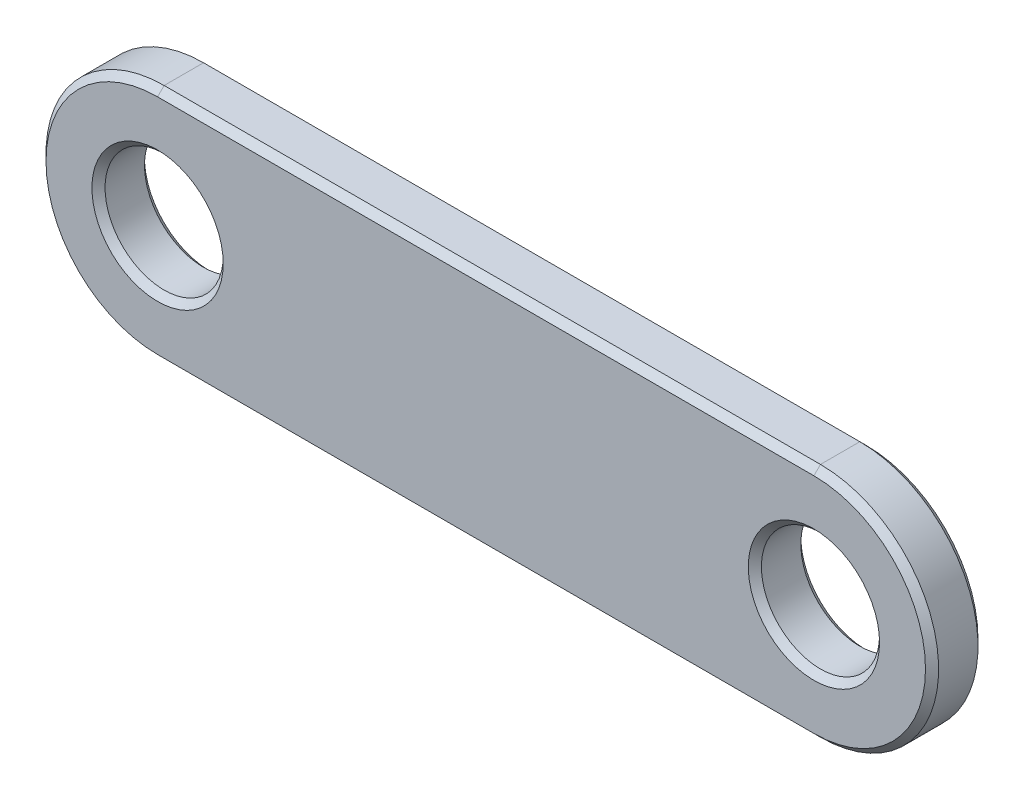
ISO-10303-21;
HEADER;
FILE_DESCRIPTION(('STEP AP214'),'2;1');
FILE_NAME('part.step','',(''),(''),'','','');
FILE_SCHEMA(('AUTOMOTIVE_DESIGN { 1 0 10303 214 1 1 1 1 }'));
ENDSEC;
DATA;
#1=APPLICATION_CONTEXT('core data for automotive mechanical design processes');
#2=APPLICATION_PROTOCOL_DEFINITION('international standard','automotive_design',2000,#1);
#3=PRODUCT_CONTEXT('',#1,'mechanical');
#4=PRODUCT('Part','Part','',(#3));
#5=PRODUCT_RELATED_PRODUCT_CATEGORY('part','',(#4));
#6=PRODUCT_DEFINITION_FORMATION('','',#4);
#7=PRODUCT_DEFINITION_CONTEXT('part definition',#1,'design');
#8=PRODUCT_DEFINITION('design','',#6,#7);
#9=PRODUCT_DEFINITION_SHAPE('','',#8);
#10=(LENGTH_UNIT() NAMED_UNIT(*) SI_UNIT(.MILLI.,.METRE.));
#11=(NAMED_UNIT(*) PLANE_ANGLE_UNIT() SI_UNIT($,.RADIAN.));
#12=(NAMED_UNIT(*) SI_UNIT($,.STERADIAN.) SOLID_ANGLE_UNIT());
#13=UNCERTAINTY_MEASURE_WITH_UNIT(LENGTH_MEASURE(1.E-05),#10,'distance_accuracy_value','');
#14=(GEOMETRIC_REPRESENTATION_CONTEXT(3) GLOBAL_UNCERTAINTY_ASSIGNED_CONTEXT((#13)) GLOBAL_UNIT_ASSIGNED_CONTEXT((#10,
#11,#12)) REPRESENTATION_CONTEXT('',''));
#15=CARTESIAN_POINT('',(0.,0.,0.));
#16=DIRECTION('',(0.,0.,1.));
#17=DIRECTION('',(1.,0.,0.));
#18=AXIS2_PLACEMENT_3D('',#15,#16,#17);
#19=CARTESIAN_POINT('',(-63.5,0.,5.08));
#20=DIRECTION('',(0.,0.,1.));
#21=DIRECTION('',(1.,0.,0.));
#22=AXIS2_PLACEMENT_3D('',#19,#20,#21);
#23=PLANE('',#22);
#24=CARTESIAN_POINT('',(-63.5,0.,5.08));
#25=DIRECTION('',(0.,0.,1.));
#26=DIRECTION('',(1.,0.,0.));
#27=AXIS2_PLACEMENT_3D('',#24,#25,#26);
#28=CIRCLE('',#27,6.35);
#29=CARTESIAN_POINT('',(-57.15,0.,5.08));
#30=VERTEX_POINT('',#29);
#31=EDGE_CURVE('E9',#30,#30,#28,.F.);
#32=ORIENTED_EDGE('',*,*,#31,.T.);
#33=EDGE_LOOP('',(#32));
#34=FACE_BOUND('',#33,.T.);
#35=CARTESIAN_POINT('',(0.,0.,5.08));
#36=DIRECTION('',(0.,0.,1.));
#37=DIRECTION('',(1.,0.,0.));
#38=AXIS2_PLACEMENT_3D('',#35,#36,#37);
#39=CIRCLE('',#38,10.795);
#40=CARTESIAN_POINT('',(0.,-10.795,5.08));
#41=VERTEX_POINT('',#40);
#42=CARTESIAN_POINT('',(0.,10.795,5.08));
#43=VERTEX_POINT('',#42);
#44=EDGE_CURVE('E31',#41,#43,#39,.T.);
#45=ORIENTED_EDGE('',*,*,#44,.T.);
#46=DIRECTION('',(-1.,0.,0.));
#47=VECTOR('',#46,1.);
#48=CARTESIAN_POINT('',(-63.5,10.795,5.08));
#49=LINE('',#48,#47);
#50=CARTESIAN_POINT('',(-63.5,10.795,5.08));
#51=VERTEX_POINT('',#50);
#52=EDGE_CURVE('E23',#43,#51,#49,.T.);
#53=ORIENTED_EDGE('',*,*,#52,.T.);
#54=CARTESIAN_POINT('',(-63.5,0.,5.08));
#55=DIRECTION('',(0.,0.,1.));
#56=DIRECTION('',(1.,0.,0.));
#57=AXIS2_PLACEMENT_3D('',#54,#55,#56);
#58=CIRCLE('',#57,10.795);
#59=CARTESIAN_POINT('',(-63.5,-10.795,5.08));
#60=VERTEX_POINT('',#59);
#61=EDGE_CURVE('E149',#51,#60,#58,.T.);
#62=ORIENTED_EDGE('',*,*,#61,.T.);
#63=DIRECTION('',(1.,0.,0.));
#64=VECTOR('',#63,1.);
#65=CARTESIAN_POINT('',(0.,-10.795,5.08));
#66=LINE('',#65,#64);
#67=EDGE_CURVE('E36',#60,#41,#66,.T.);
#68=ORIENTED_EDGE('',*,*,#67,.T.);
#69=EDGE_LOOP('',(#45,#53,#62,#68));
#70=FACE_BOUND('',#69,.T.);
#71=CARTESIAN_POINT('',(0.,0.,5.08));
#72=DIRECTION('',(0.,0.,1.));
#73=DIRECTION('',(1.,0.,0.));
#74=AXIS2_PLACEMENT_3D('',#71,#72,#73);
#75=CIRCLE('',#74,6.35);
#76=CARTESIAN_POINT('',(6.35,0.,5.08));
#77=VERTEX_POINT('',#76);
#78=EDGE_CURVE('E146',#77,#77,#75,.F.);
#79=ORIENTED_EDGE('',*,*,#78,.T.);
#80=EDGE_LOOP('',(#79));
#81=FACE_BOUND('',#80,.T.);
#82=ADVANCED_FACE('F14',(#34,#70,#81),#23,.T.);
#83=CARTESIAN_POINT('',(-63.5,0.,0.));
#84=DIRECTION('',(0.,0.,1.));
#85=DIRECTION('',(1.,0.,0.));
#86=AXIS2_PLACEMENT_3D('',#83,#84,#85);
#87=PLANE('',#86);
#88=CARTESIAN_POINT('',(-63.5,0.,0.));
#89=DIRECTION('',(0.,0.,1.));
#90=DIRECTION('',(1.,0.,0.));
#91=AXIS2_PLACEMENT_3D('',#88,#89,#90);
#92=CIRCLE('',#91,6.35);
#93=CARTESIAN_POINT('',(-57.15,0.,0.));
#94=VERTEX_POINT('',#93);
#95=EDGE_CURVE('E111',#94,#94,#92,.T.);
#96=ORIENTED_EDGE('',*,*,#95,.T.);
#97=EDGE_LOOP('',(#96));
#98=FACE_BOUND('',#97,.T.);
#99=CARTESIAN_POINT('',(0.,0.,0.));
#100=DIRECTION('',(0.,0.,1.));
#101=DIRECTION('',(1.,0.,0.));
#102=AXIS2_PLACEMENT_3D('',#99,#100,#101);
#103=CIRCLE('',#102,6.35);
#104=CARTESIAN_POINT('',(6.35,0.,0.));
#105=VERTEX_POINT('',#104);
#106=EDGE_CURVE('E108',#105,#105,#103,.T.);
#107=ORIENTED_EDGE('',*,*,#106,.T.);
#108=EDGE_LOOP('',(#107));
#109=FACE_BOUND('',#108,.T.);
#110=CARTESIAN_POINT('',(0.,0.,0.));
#111=DIRECTION('',(0.,0.,1.));
#112=DIRECTION('',(1.,0.,0.));
#113=AXIS2_PLACEMENT_3D('',#110,#111,#112);
#114=CIRCLE('',#113,10.795);
#115=CARTESIAN_POINT('',(0.,10.795,0.));
#116=VERTEX_POINT('',#115);
#117=CARTESIAN_POINT('',(0.,-10.795,0.));
#118=VERTEX_POINT('',#117);
#119=EDGE_CURVE('E107',#116,#118,#114,.F.);
#120=ORIENTED_EDGE('',*,*,#119,.T.);
#121=DIRECTION('',(-1.,0.,0.));
#122=VECTOR('',#121,1.);
#123=CARTESIAN_POINT('',(-63.5,-10.795,0.));
#124=LINE('',#123,#122);
#125=CARTESIAN_POINT('',(-63.5,-10.795,0.));
#126=VERTEX_POINT('',#125);
#127=EDGE_CURVE('E86',#118,#126,#124,.T.);
#128=ORIENTED_EDGE('',*,*,#127,.T.);
#129=CARTESIAN_POINT('',(-63.5,0.,0.));
#130=DIRECTION('',(0.,0.,1.));
#131=DIRECTION('',(1.,0.,0.));
#132=AXIS2_PLACEMENT_3D('',#129,#130,#131);
#133=CIRCLE('',#132,10.795);
#134=CARTESIAN_POINT('',(-63.5,10.795,0.));
#135=VERTEX_POINT('',#134);
#136=EDGE_CURVE('E96',#126,#135,#133,.F.);
#137=ORIENTED_EDGE('',*,*,#136,.T.);
#138=DIRECTION('',(1.,0.,0.));
#139=VECTOR('',#138,1.);
#140=CARTESIAN_POINT('',(-63.5,10.795,0.));
#141=LINE('',#140,#139);
#142=EDGE_CURVE('E102',#135,#116,#141,.T.);
#143=ORIENTED_EDGE('',*,*,#142,.T.);
#144=EDGE_LOOP('',(#120,#128,#137,#143));
#145=FACE_BOUND('',#144,.T.);
#146=ADVANCED_FACE('F105',(#98,#109,#145),#87,.F.);
#147=CARTESIAN_POINT('',(-63.5,0.,5.08));
#148=DIRECTION('',(0.,0.,-1.));
#149=DIRECTION('',(-1.,0.,0.));
#150=AXIS2_PLACEMENT_3D('',#147,#148,#149);
#151=CYLINDRICAL_SURFACE('',#150,11.43);
#152=DIRECTION('',(0.,0.,-1.));
#153=VECTOR('',#152,1.);
#154=CARTESIAN_POINT('',(-63.5,11.43,5.08));
#155=LINE('',#154,#153);
#156=CARTESIAN_POINT('',(-63.5,11.43,4.445));
#157=VERTEX_POINT('',#156);
#158=CARTESIAN_POINT('',(-63.5,11.43,0.635000000000009));
#159=VERTEX_POINT('',#158);
#160=EDGE_CURVE('E158',#157,#159,#155,.T.);
#161=ORIENTED_EDGE('',*,*,#160,.T.);
#162=CARTESIAN_POINT('',(-63.5,0.,0.635000000000009));
#163=DIRECTION('',(0.,0.,1.));
#164=DIRECTION('',(1.,0.,0.));
#165=AXIS2_PLACEMENT_3D('',#162,#163,#164);
#166=CIRCLE('',#165,11.43);
#167=CARTESIAN_POINT('',(-63.5,-11.43,0.635000000000009));
#168=VERTEX_POINT('',#167);
#169=EDGE_CURVE('E144',#159,#168,#166,.T.);
#170=ORIENTED_EDGE('',*,*,#169,.T.);
#171=DIRECTION('',(0.,0.,-1.));
#172=VECTOR('',#171,1.);
#173=CARTESIAN_POINT('',(-63.5,-11.43,5.08));
#174=LINE('',#173,#172);
#175=CARTESIAN_POINT('',(-63.5,-11.43,4.445));
#176=VERTEX_POINT('',#175);
#177=EDGE_CURVE('E103',#176,#168,#174,.T.);
#178=ORIENTED_EDGE('',*,*,#177,.F.);
#179=CARTESIAN_POINT('',(-63.5,0.,4.445));
#180=DIRECTION('',(0.,0.,1.));
#181=DIRECTION('',(1.,0.,0.));
#182=AXIS2_PLACEMENT_3D('',#179,#180,#181);
#183=CIRCLE('',#182,11.43);
#184=EDGE_CURVE('E142',#176,#157,#183,.F.);
#185=ORIENTED_EDGE('',*,*,#184,.T.);
#186=EDGE_LOOP('',(#161,#170,#178,#185));
#187=FACE_BOUND('',#186,.T.);
#188=ADVANCED_FACE('F184',(#187),#151,.T.);
#189=CARTESIAN_POINT('',(-63.5,-11.43,5.08));
#190=DIRECTION('',(0.,1.,0.));
#191=DIRECTION('',(0.,0.,1.));
#192=AXIS2_PLACEMENT_3D('',#189,#190,#191);
#193=PLANE('',#192);
#194=ORIENTED_EDGE('',*,*,#177,.T.);
#195=DIRECTION('',(1.,0.,0.));
#196=VECTOR('',#195,1.);
#197=CARTESIAN_POINT('',(-63.5,-11.43,0.635000000000009));
#198=LINE('',#197,#196);
#199=CARTESIAN_POINT('',(0.,-11.43,0.635000000000009));
#200=VERTEX_POINT('',#199);
#201=EDGE_CURVE('E89',#168,#200,#198,.T.);
#202=ORIENTED_EDGE('',*,*,#201,.T.);
#203=DIRECTION('',(0.,0.,-1.));
#204=VECTOR('',#203,1.);
#205=CARTESIAN_POINT('',(0.,-11.43,5.08));
#206=LINE('',#205,#204);
#207=CARTESIAN_POINT('',(0.,-11.43,4.445));
#208=VERTEX_POINT('',#207);
#209=EDGE_CURVE('E181',#208,#200,#206,.T.);
#210=ORIENTED_EDGE('',*,*,#209,.F.);
#211=DIRECTION('',(-1.,0.,0.));
#212=VECTOR('',#211,1.);
#213=CARTESIAN_POINT('',(-63.5,-11.43,4.445));
#214=LINE('',#213,#212);
#215=EDGE_CURVE('E130',#208,#176,#214,.T.);
#216=ORIENTED_EDGE('',*,*,#215,.T.);
#217=EDGE_LOOP('',(#194,#202,#210,#216));
#218=FACE_BOUND('',#217,.T.);
#219=ADVANCED_FACE('F179',(#218),#193,.F.);
#220=CARTESIAN_POINT('',(0.,0.,5.08));
#221=DIRECTION('',(0.,0.,-1.));
#222=DIRECTION('',(-1.,0.,0.));
#223=AXIS2_PLACEMENT_3D('',#220,#221,#222);
#224=CYLINDRICAL_SURFACE('',#223,11.43);
#225=ORIENTED_EDGE('',*,*,#209,.T.);
#226=CARTESIAN_POINT('',(0.,0.,0.635000000000009));
#227=DIRECTION('',(0.,0.,1.));
#228=DIRECTION('',(1.,0.,0.));
#229=AXIS2_PLACEMENT_3D('',#226,#227,#228);
#230=CIRCLE('',#229,11.43);
#231=CARTESIAN_POINT('',(0.,11.43,0.635000000000009));
#232=VERTEX_POINT('',#231);
#233=EDGE_CURVE('E135',#200,#232,#230,.T.);
#234=ORIENTED_EDGE('',*,*,#233,.T.);
#235=DIRECTION('',(0.,0.,-1.));
#236=VECTOR('',#235,1.);
#237=CARTESIAN_POINT('',(0.,11.43,5.08));
#238=LINE('',#237,#236);
#239=CARTESIAN_POINT('',(0.,11.43,4.445));
#240=VERTEX_POINT('',#239);
#241=EDGE_CURVE('E187',#240,#232,#238,.T.);
#242=ORIENTED_EDGE('',*,*,#241,.F.);
#243=CARTESIAN_POINT('',(0.,0.,4.445));
#244=DIRECTION('',(0.,0.,1.));
#245=DIRECTION('',(1.,0.,0.));
#246=AXIS2_PLACEMENT_3D('',#243,#244,#245);
#247=CIRCLE('',#246,11.43);
#248=EDGE_CURVE('E133',#240,#208,#247,.F.);
#249=ORIENTED_EDGE('',*,*,#248,.T.);
#250=EDGE_LOOP('',(#225,#234,#242,#249));
#251=FACE_BOUND('',#250,.T.);
#252=ADVANCED_FACE('F200',(#251),#224,.T.);
#253=CARTESIAN_POINT('',(-63.5,11.43,5.08));
#254=DIRECTION('',(0.,-1.,0.));
#255=DIRECTION('',(0.,0.,-1.));
#256=AXIS2_PLACEMENT_3D('',#253,#254,#255);
#257=PLANE('',#256);
#258=ORIENTED_EDGE('',*,*,#241,.T.);
#259=DIRECTION('',(-1.,0.,0.));
#260=VECTOR('',#259,1.);
#261=CARTESIAN_POINT('',(-63.5,11.43,0.635000000000009));
#262=LINE('',#261,#260);
#263=EDGE_CURVE('E140',#232,#159,#262,.T.);
#264=ORIENTED_EDGE('',*,*,#263,.T.);
#265=ORIENTED_EDGE('',*,*,#160,.F.);
#266=DIRECTION('',(1.,0.,0.));
#267=VECTOR('',#266,1.);
#268=CARTESIAN_POINT('',(0.,11.43,4.445));
#269=LINE('',#268,#267);
#270=EDGE_CURVE('E137',#157,#240,#269,.T.);
#271=ORIENTED_EDGE('',*,*,#270,.T.);
#272=EDGE_LOOP('',(#258,#264,#265,#271));
#273=FACE_BOUND('',#272,.T.);
#274=ADVANCED_FACE('F204',(#273),#257,.F.);
#275=CARTESIAN_POINT('',(0.,0.,5.08));
#276=DIRECTION('',(0.,0.,-1.));
#277=DIRECTION('',(-1.,0.,0.));
#278=AXIS2_PLACEMENT_3D('',#275,#276,#277);
#279=CYLINDRICAL_SURFACE('',#278,5.715);
#280=CARTESIAN_POINT('',(0.,0.,0.635));
#281=DIRECTION('',(0.,0.,1.));
#282=DIRECTION('',(1.,0.,0.));
#283=AXIS2_PLACEMENT_3D('',#280,#281,#282);
#284=CIRCLE('',#283,5.715);
#285=CARTESIAN_POINT('',(5.715,0.,0.635));
#286=VERTEX_POINT('',#285);
#287=EDGE_CURVE('E127',#286,#286,#284,.F.);
#288=ORIENTED_EDGE('',*,*,#287,.T.);
#289=EDGE_LOOP('',(#288));
#290=FACE_BOUND('',#289,.T.);
#291=CARTESIAN_POINT('',(0.,0.,4.445));
#292=DIRECTION('',(0.,0.,1.));
#293=DIRECTION('',(1.,0.,0.));
#294=AXIS2_PLACEMENT_3D('',#291,#292,#293);
#295=CIRCLE('',#294,5.715);
#296=CARTESIAN_POINT('',(5.715,0.,4.445));
#297=VERTEX_POINT('',#296);
#298=EDGE_CURVE('E124',#297,#297,#295,.T.);
#299=ORIENTED_EDGE('',*,*,#298,.T.);
#300=EDGE_LOOP('',(#299));
#301=FACE_BOUND('',#300,.T.);
#302=ADVANCED_FACE('F220',(#290,#301),#279,.F.);
#303=CARTESIAN_POINT('',(-63.5,0.,5.08));
#304=DIRECTION('',(0.,0.,-1.));
#305=DIRECTION('',(-1.,0.,0.));
#306=AXIS2_PLACEMENT_3D('',#303,#304,#305);
#307=CYLINDRICAL_SURFACE('',#306,5.715);
#308=CARTESIAN_POINT('',(-63.5,0.,0.634999999999985));
#309=DIRECTION('',(0.,0.,1.));
#310=DIRECTION('',(1.,0.,0.));
#311=AXIS2_PLACEMENT_3D('',#308,#309,#310);
#312=CIRCLE('',#311,5.715);
#313=CARTESIAN_POINT('',(-57.785,0.,0.634999999999985));
#314=VERTEX_POINT('',#313);
#315=EDGE_CURVE('E121',#314,#314,#312,.F.);
#316=ORIENTED_EDGE('',*,*,#315,.T.);
#317=EDGE_LOOP('',(#316));
#318=FACE_BOUND('',#317,.T.);
#319=CARTESIAN_POINT('',(-63.5,0.,4.445));
#320=DIRECTION('',(0.,0.,1.));
#321=DIRECTION('',(1.,0.,0.));
#322=AXIS2_PLACEMENT_3D('',#319,#320,#321);
#323=CIRCLE('',#322,5.715);
#324=CARTESIAN_POINT('',(-57.785,0.,4.445));
#325=VERTEX_POINT('',#324);
#326=EDGE_CURVE('E118',#325,#325,#323,.T.);
#327=ORIENTED_EDGE('',*,*,#326,.T.);
#328=EDGE_LOOP('',(#327));
#329=FACE_BOUND('',#328,.T.);
#330=ADVANCED_FACE('F222',(#318,#329),#307,.F.);
#331=CARTESIAN_POINT('',(-63.5,0.,0.));
#332=DIRECTION('',(0.,0.,-1.));
#333=DIRECTION('',(-1.,0.,0.));
#334=AXIS2_PLACEMENT_3D('',#331,#332,#333);
#335=CONICAL_SURFACE('',#334,6.35,0.78539816339745);
#336=ORIENTED_EDGE('',*,*,#315,.F.);
#337=EDGE_LOOP('',(#336));
#338=FACE_BOUND('',#337,.T.);
#339=ORIENTED_EDGE('',*,*,#95,.F.);
#340=EDGE_LOOP('',(#339));
#341=FACE_BOUND('',#340,.T.);
#342=ADVANCED_FACE('F231',(#338,#341),#335,.F.);
#343=CARTESIAN_POINT('',(0.,0.,0.));
#344=DIRECTION('',(0.,0.,-1.));
#345=DIRECTION('',(-1.,0.,0.));
#346=AXIS2_PLACEMENT_3D('',#343,#344,#345);
#347=CONICAL_SURFACE('',#346,6.35,0.785398163397442);
#348=ORIENTED_EDGE('',*,*,#287,.F.);
#349=EDGE_LOOP('',(#348));
#350=FACE_BOUND('',#349,.T.);
#351=ORIENTED_EDGE('',*,*,#106,.F.);
#352=EDGE_LOOP('',(#351));
#353=FACE_BOUND('',#352,.T.);
#354=ADVANCED_FACE('F247',(#350,#353),#347,.F.);
#355=CARTESIAN_POINT('',(-63.5,11.43,0.635000000000009));
#356=DIRECTION('',(0.,-0.707106781186554,0.707106781186541));
#357=DIRECTION('',(-1.,0.,0.));
#358=AXIS2_PLACEMENT_3D('',#355,#356,#357);
#359=PLANE('',#358);
#360=DIRECTION('',(0.,0.707106781186541,0.707106781186554));
#361=VECTOR('',#360,1.);
#362=CARTESIAN_POINT('',(0.,10.795,0.));
#363=LINE('',#362,#361);
#364=EDGE_CURVE('E92',#116,#232,#363,.T.);
#365=ORIENTED_EDGE('',*,*,#364,.F.);
#366=ORIENTED_EDGE('',*,*,#142,.F.);
#367=DIRECTION('',(0.,-0.707106781186541,-0.707106781186554));
#368=VECTOR('',#367,1.);
#369=CARTESIAN_POINT('',(-63.5,11.43,0.635000000000009));
#370=LINE('',#369,#368);
#371=EDGE_CURVE('E99',#159,#135,#370,.T.);
#372=ORIENTED_EDGE('',*,*,#371,.F.);
#373=ORIENTED_EDGE('',*,*,#263,.F.);
#374=EDGE_LOOP('',(#365,#366,#372,#373));
#375=FACE_BOUND('',#374,.T.);
#376=ADVANCED_FACE('F193',(#375),#359,.F.);
#377=CARTESIAN_POINT('',(-63.5,0.,0.635000000000009));
#378=DIRECTION('',(0.,0.,1.));
#379=DIRECTION('',(1.,0.,0.));
#380=AXIS2_PLACEMENT_3D('',#377,#378,#379);
#381=CONICAL_SURFACE('',#380,11.43,0.785398163397439);
#382=ORIENTED_EDGE('',*,*,#371,.T.);
#383=ORIENTED_EDGE('',*,*,#136,.F.);
#384=DIRECTION('',(0.,0.707106781186541,-0.707106781186554));
#385=VECTOR('',#384,1.);
#386=CARTESIAN_POINT('',(-63.5,-11.43,0.635000000000009));
#387=LINE('',#386,#385);
#388=EDGE_CURVE('E82',#168,#126,#387,.T.);
#389=ORIENTED_EDGE('',*,*,#388,.F.);
#390=ORIENTED_EDGE('',*,*,#169,.F.);
#391=EDGE_LOOP('',(#382,#383,#389,#390));
#392=FACE_BOUND('',#391,.T.);
#393=ADVANCED_FACE('F97',(#392),#381,.T.);
#394=CARTESIAN_POINT('',(0.,0.,0.635000000000009));
#395=DIRECTION('',(0.,0.,1.));
#396=DIRECTION('',(1.,0.,0.));
#397=AXIS2_PLACEMENT_3D('',#394,#395,#396);
#398=CONICAL_SURFACE('',#397,11.43,0.785398163397439);
#399=ORIENTED_EDGE('',*,*,#364,.T.);
#400=ORIENTED_EDGE('',*,*,#233,.F.);
#401=DIRECTION('',(0.,-0.707106781186541,0.707106781186554));
#402=VECTOR('',#401,1.);
#403=CARTESIAN_POINT('',(0.,-10.795,0.));
#404=LINE('',#403,#402);
#405=EDGE_CURVE('E93',#118,#200,#404,.T.);
#406=ORIENTED_EDGE('',*,*,#405,.F.);
#407=ORIENTED_EDGE('',*,*,#119,.F.);
#408=EDGE_LOOP('',(#399,#400,#406,#407));
#409=FACE_BOUND('',#408,.T.);
#410=ADVANCED_FACE('F196',(#409),#398,.T.);
#411=CARTESIAN_POINT('',(-63.5,-11.43,0.635000000000009));
#412=DIRECTION('',(0.,0.707106781186554,0.707106781186541));
#413=DIRECTION('',(1.,0.,0.));
#414=AXIS2_PLACEMENT_3D('',#411,#412,#413);
#415=PLANE('',#414);
#416=ORIENTED_EDGE('',*,*,#388,.T.);
#417=ORIENTED_EDGE('',*,*,#127,.F.);
#418=ORIENTED_EDGE('',*,*,#405,.T.);
#419=ORIENTED_EDGE('',*,*,#201,.F.);
#420=EDGE_LOOP('',(#416,#417,#418,#419));
#421=FACE_BOUND('',#420,.T.);
#422=ADVANCED_FACE('F84',(#421),#415,.F.);
#423=CARTESIAN_POINT('',(-63.5,0.,4.445));
#424=DIRECTION('',(0.,0.,1.));
#425=DIRECTION('',(1.,0.,0.));
#426=AXIS2_PLACEMENT_3D('',#423,#424,#425);
#427=CONICAL_SURFACE('',#426,5.715,0.785398163397449);
#428=ORIENTED_EDGE('',*,*,#31,.F.);
#429=EDGE_LOOP('',(#428));
#430=FACE_BOUND('',#429,.T.);
#431=ORIENTED_EDGE('',*,*,#326,.F.);
#432=EDGE_LOOP('',(#431));
#433=FACE_BOUND('',#432,.T.);
#434=ADVANCED_FACE('F254',(#430,#433),#427,.F.);
#435=CARTESIAN_POINT('',(-63.5,-10.795,5.08));
#436=DIRECTION('',(0.,-0.707106781186543,0.707106781186552));
#437=DIRECTION('',(-1.,0.,0.));
#438=AXIS2_PLACEMENT_3D('',#435,#436,#437);
#439=PLANE('',#438);
#440=DIRECTION('',(0.,0.707106781186552,0.707106781186543));
#441=VECTOR('',#440,1.);
#442=CARTESIAN_POINT('',(-63.5,-11.43,4.445));
#443=LINE('',#442,#441);
#444=EDGE_CURVE('E162',#176,#60,#443,.T.);
#445=ORIENTED_EDGE('',*,*,#444,.F.);
#446=ORIENTED_EDGE('',*,*,#215,.F.);
#447=DIRECTION('',(0.,-0.707106781186552,-0.707106781186543));
#448=VECTOR('',#447,1.);
#449=CARTESIAN_POINT('',(0.,-10.795,5.08));
#450=LINE('',#449,#448);
#451=EDGE_CURVE('E18',#41,#208,#450,.T.);
#452=ORIENTED_EDGE('',*,*,#451,.F.);
#453=ORIENTED_EDGE('',*,*,#67,.F.);
#454=EDGE_LOOP('',(#445,#446,#452,#453));
#455=FACE_BOUND('',#454,.T.);
#456=ADVANCED_FACE('F174',(#455),#439,.T.);
#457=CARTESIAN_POINT('',(0.,0.,5.08));
#458=DIRECTION('',(0.,0.,-1.));
#459=DIRECTION('',(-1.,0.,0.));
#460=AXIS2_PLACEMENT_3D('',#457,#458,#459);
#461=CONICAL_SURFACE('',#460,10.795,0.785398163397455);
#462=ORIENTED_EDGE('',*,*,#451,.T.);
#463=ORIENTED_EDGE('',*,*,#248,.F.);
#464=DIRECTION('',(0.,0.707106781186552,-0.707106781186543));
#465=VECTOR('',#464,1.);
#466=CARTESIAN_POINT('',(0.,10.795,5.08));
#467=LINE('',#466,#465);
#468=EDGE_CURVE('E161',#43,#240,#467,.T.);
#469=ORIENTED_EDGE('',*,*,#468,.F.);
#470=ORIENTED_EDGE('',*,*,#44,.F.);
#471=EDGE_LOOP('',(#462,#463,#469,#470));
#472=FACE_BOUND('',#471,.T.);
#473=ADVANCED_FACE('F171',(#472),#461,.T.);
#474=CARTESIAN_POINT('',(-63.5,0.,5.08));
#475=DIRECTION('',(0.,0.,-1.));
#476=DIRECTION('',(-1.,0.,0.));
#477=AXIS2_PLACEMENT_3D('',#474,#475,#476);
#478=CONICAL_SURFACE('',#477,10.795,0.785398163397455);
#479=ORIENTED_EDGE('',*,*,#444,.T.);
#480=ORIENTED_EDGE('',*,*,#61,.F.);
#481=DIRECTION('',(0.,-0.707106781186552,0.707106781186543));
#482=VECTOR('',#481,1.);
#483=CARTESIAN_POINT('',(-63.5,11.43,4.445));
#484=LINE('',#483,#482);
#485=EDGE_CURVE('E159',#157,#51,#484,.T.);
#486=ORIENTED_EDGE('',*,*,#485,.F.);
#487=ORIENTED_EDGE('',*,*,#184,.F.);
#488=EDGE_LOOP('',(#479,#480,#486,#487));
#489=FACE_BOUND('',#488,.T.);
#490=ADVANCED_FACE('F209',(#489),#478,.T.);
#491=CARTESIAN_POINT('',(-63.5,10.795,5.08));
#492=DIRECTION('',(0.,0.707106781186543,0.707106781186552));
#493=DIRECTION('',(1.,0.,0.));
#494=AXIS2_PLACEMENT_3D('',#491,#492,#493);
#495=PLANE('',#494);
#496=ORIENTED_EDGE('',*,*,#468,.T.);
#497=ORIENTED_EDGE('',*,*,#270,.F.);
#498=ORIENTED_EDGE('',*,*,#485,.T.);
#499=ORIENTED_EDGE('',*,*,#52,.F.);
#500=EDGE_LOOP('',(#496,#497,#498,#499));
#501=FACE_BOUND('',#500,.T.);
#502=ADVANCED_FACE('F207',(#501),#495,.T.);
#503=CARTESIAN_POINT('',(0.,0.,4.445));
#504=DIRECTION('',(0.,0.,1.));
#505=DIRECTION('',(1.,0.,0.));
#506=AXIS2_PLACEMENT_3D('',#503,#504,#505);
#507=CONICAL_SURFACE('',#506,5.715,0.785398163397449);
#508=ORIENTED_EDGE('',*,*,#78,.F.);
#509=EDGE_LOOP('',(#508));
#510=FACE_BOUND('',#509,.T.);
#511=ORIENTED_EDGE('',*,*,#298,.F.);
#512=EDGE_LOOP('',(#511));
#513=FACE_BOUND('',#512,.T.);
#514=ADVANCED_FACE('F16',(#510,#513),#507,.F.);
#515=CLOSED_SHELL('',(#82,#146,#188,#219,#252,#274,#302,#330,#342,#354,#376,#393,#410,#422,#434,
#456,#473,#490,#502,#514));
#516=MANIFOLD_SOLID_BREP('B1',#515);
#517=ADVANCED_BREP_SHAPE_REPRESENTATION('',(#18,#516),#14);
#518=SHAPE_DEFINITION_REPRESENTATION(#9,#517);
ENDSEC;
END-ISO-10303-21;
